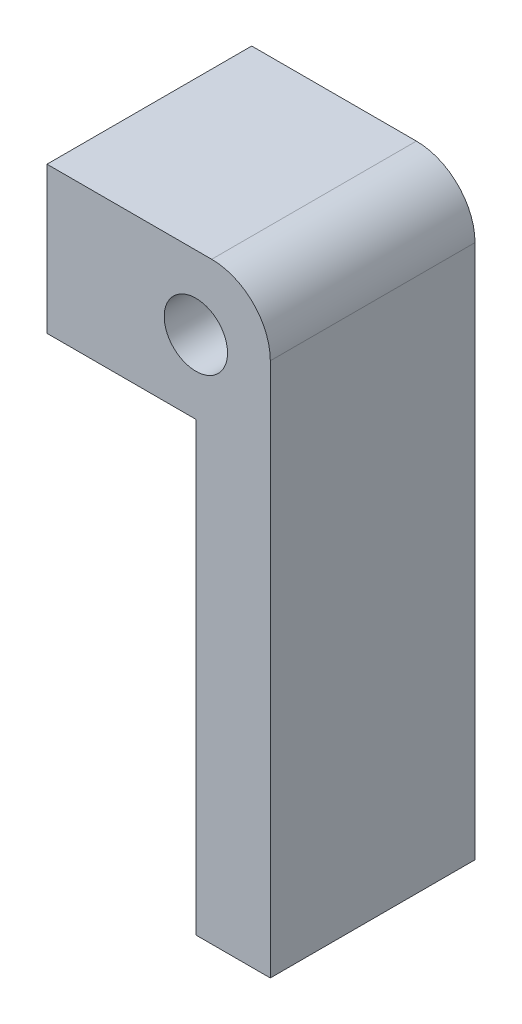
ISO-10303-21;
HEADER;
FILE_DESCRIPTION(('STEP AP214'),'2;1');
FILE_NAME('part.step','',(''),(''),'','','');
FILE_SCHEMA(('AUTOMOTIVE_DESIGN { 1 0 10303 214 1 1 1 1 }'));
ENDSEC;
DATA;
#1=APPLICATION_CONTEXT('core data for automotive mechanical design processes');
#2=APPLICATION_PROTOCOL_DEFINITION('international standard','automotive_design',2000,#1);
#3=PRODUCT_CONTEXT('',#1,'mechanical');
#4=PRODUCT('Part','Part','',(#3));
#5=PRODUCT_RELATED_PRODUCT_CATEGORY('part','',(#4));
#6=PRODUCT_DEFINITION_FORMATION('','',#4);
#7=PRODUCT_DEFINITION_CONTEXT('part definition',#1,'design');
#8=PRODUCT_DEFINITION('design','',#6,#7);
#9=PRODUCT_DEFINITION_SHAPE('','',#8);
#10=(LENGTH_UNIT() NAMED_UNIT(*) SI_UNIT(.MILLI.,.METRE.));
#11=(NAMED_UNIT(*) PLANE_ANGLE_UNIT() SI_UNIT($,.RADIAN.));
#12=(NAMED_UNIT(*) SI_UNIT($,.STERADIAN.) SOLID_ANGLE_UNIT());
#13=UNCERTAINTY_MEASURE_WITH_UNIT(LENGTH_MEASURE(1.E-05),#10,'distance_accuracy_value','');
#14=(GEOMETRIC_REPRESENTATION_CONTEXT(3) GLOBAL_UNCERTAINTY_ASSIGNED_CONTEXT((#13)) GLOBAL_UNIT_ASSIGNED_CONTEXT((#10,
#11,#12)) REPRESENTATION_CONTEXT('',''));
#15=CARTESIAN_POINT('',(0.,0.,0.));
#16=DIRECTION('',(0.,0.,1.));
#17=DIRECTION('',(1.,0.,0.));
#18=AXIS2_PLACEMENT_3D('',#15,#16,#17);
#19=CARTESIAN_POINT('',(0.,0.,34.925));
#20=DIRECTION('',(0.,1.,0.));
#21=DIRECTION('',(0.,0.,1.));
#22=AXIS2_PLACEMENT_3D('',#19,#20,#21);
#23=PLANE('',#22);
#24=DIRECTION('',(1.,0.,0.));
#25=VECTOR('',#24,1.);
#26=CARTESIAN_POINT('',(0.,0.,0.));
#27=LINE('',#26,#25);
#28=CARTESIAN_POINT('',(0.,0.,0.));
#29=VERTEX_POINT('',#28);
#30=CARTESIAN_POINT('',(25.4,0.,0.));
#31=VERTEX_POINT('',#30);
#32=EDGE_CURVE('E127',#29,#31,#27,.T.);
#33=ORIENTED_EDGE('',*,*,#32,.T.);
#34=DIRECTION('',(0.,0.,-1.));
#35=VECTOR('',#34,1.);
#36=CARTESIAN_POINT('',(25.4,0.,34.925));
#37=LINE('',#36,#35);
#38=CARTESIAN_POINT('',(25.4,0.,34.925));
#39=VERTEX_POINT('',#38);
#40=EDGE_CURVE('E105',#39,#31,#37,.T.);
#41=ORIENTED_EDGE('',*,*,#40,.F.);
#42=DIRECTION('',(1.,0.,0.));
#43=VECTOR('',#42,1.);
#44=CARTESIAN_POINT('',(0.,0.,34.925));
#45=LINE('',#44,#43);
#46=CARTESIAN_POINT('',(0.,0.,34.925));
#47=VERTEX_POINT('',#46);
#48=EDGE_CURVE('E114',#47,#39,#45,.T.);
#49=ORIENTED_EDGE('',*,*,#48,.F.);
#50=DIRECTION('',(0.,0.,-1.));
#51=VECTOR('',#50,1.);
#52=CARTESIAN_POINT('',(0.,0.,34.925));
#53=LINE('',#52,#51);
#54=EDGE_CURVE('E147',#47,#29,#53,.T.);
#55=ORIENTED_EDGE('',*,*,#54,.T.);
#56=EDGE_LOOP('',(#33,#41,#49,#55));
#57=FACE_BOUND('',#56,.T.);
#58=ADVANCED_FACE('F43',(#57),#23,.F.);
#59=CARTESIAN_POINT('',(25.4,0.,34.925));
#60=DIRECTION('',(1.,0.,0.));
#61=DIRECTION('',(0.,1.,0.));
#62=AXIS2_PLACEMENT_3D('',#59,#60,#61);
#63=PLANE('',#62);
#64=DIRECTION('',(0.,-1.,0.));
#65=VECTOR('',#64,1.);
#66=CARTESIAN_POINT('',(25.4,0.,0.));
#67=LINE('',#66,#65);
#68=CARTESIAN_POINT('',(25.4,-76.2,0.));
#69=VERTEX_POINT('',#68);
#70=EDGE_CURVE('E164',#31,#69,#67,.T.);
#71=ORIENTED_EDGE('',*,*,#70,.T.);
#72=DIRECTION('',(0.,0.,-1.));
#73=VECTOR('',#72,1.);
#74=CARTESIAN_POINT('',(25.4,-76.2,34.925));
#75=LINE('',#74,#73);
#76=CARTESIAN_POINT('',(25.4,-76.2,34.925));
#77=VERTEX_POINT('',#76);
#78=EDGE_CURVE('E108',#77,#69,#75,.T.);
#79=ORIENTED_EDGE('',*,*,#78,.F.);
#80=DIRECTION('',(0.,-1.,0.));
#81=VECTOR('',#80,1.);
#82=CARTESIAN_POINT('',(25.4,0.,34.925));
#83=LINE('',#82,#81);
#84=EDGE_CURVE('E101',#39,#77,#83,.T.);
#85=ORIENTED_EDGE('',*,*,#84,.F.);
#86=ORIENTED_EDGE('',*,*,#40,.T.);
#87=EDGE_LOOP('',(#71,#79,#85,#86));
#88=FACE_BOUND('',#87,.T.);
#89=ADVANCED_FACE('F103',(#88),#63,.F.);
#90=CARTESIAN_POINT('',(0.,-76.2,34.925));
#91=DIRECTION('',(0.,1.,0.));
#92=DIRECTION('',(0.,0.,1.));
#93=AXIS2_PLACEMENT_3D('',#90,#91,#92);
#94=PLANE('',#93);
#95=DIRECTION('',(1.,0.,0.));
#96=VECTOR('',#95,1.);
#97=CARTESIAN_POINT('',(0.,-76.2,0.));
#98=LINE('',#97,#96);
#99=CARTESIAN_POINT('',(38.1,-76.2,0.));
#100=VERTEX_POINT('',#99);
#101=EDGE_CURVE('E160',#69,#100,#98,.T.);
#102=ORIENTED_EDGE('',*,*,#101,.T.);
#103=DIRECTION('',(0.,0.,-1.));
#104=VECTOR('',#103,1.);
#105=CARTESIAN_POINT('',(38.1,-76.2,34.925));
#106=LINE('',#105,#104);
#107=CARTESIAN_POINT('',(38.1,-76.2,34.925));
#108=VERTEX_POINT('',#107);
#109=EDGE_CURVE('E135',#108,#100,#106,.T.);
#110=ORIENTED_EDGE('',*,*,#109,.F.);
#111=DIRECTION('',(1.,0.,0.));
#112=VECTOR('',#111,1.);
#113=CARTESIAN_POINT('',(0.,-76.2,34.925));
#114=LINE('',#113,#112);
#115=EDGE_CURVE('E113',#77,#108,#114,.T.);
#116=ORIENTED_EDGE('',*,*,#115,.F.);
#117=ORIENTED_EDGE('',*,*,#78,.T.);
#118=EDGE_LOOP('',(#102,#110,#116,#117));
#119=FACE_BOUND('',#118,.T.);
#120=ADVANCED_FACE('F208',(#119),#94,.F.);
#121=CARTESIAN_POINT('',(38.1,0.,34.925));
#122=DIRECTION('',(1.,0.,0.));
#123=DIRECTION('',(0.,1.,0.));
#124=AXIS2_PLACEMENT_3D('',#121,#122,#123);
#125=PLANE('',#124);
#126=DIRECTION('',(0.,-1.,0.));
#127=VECTOR('',#126,1.);
#128=CARTESIAN_POINT('',(38.1,0.,0.));
#129=LINE('',#128,#127);
#130=CARTESIAN_POINT('',(38.1,15.,0.));
#131=VERTEX_POINT('',#130);
#132=EDGE_CURVE('E157',#131,#100,#129,.T.);
#133=ORIENTED_EDGE('',*,*,#132,.F.);
#134=DIRECTION('',(0.,0.,-1.));
#135=VECTOR('',#134,1.);
#136=CARTESIAN_POINT('',(38.1,15.,34.925));
#137=LINE('',#136,#135);
#138=CARTESIAN_POINT('',(38.1,15.,34.925));
#139=VERTEX_POINT('',#138);
#140=EDGE_CURVE('E52',#131,#139,#137,.F.);
#141=ORIENTED_EDGE('',*,*,#140,.T.);
#142=DIRECTION('',(0.,-1.,0.));
#143=VECTOR('',#142,1.);
#144=CARTESIAN_POINT('',(38.1,0.,34.925));
#145=LINE('',#144,#143);
#146=EDGE_CURVE('E179',#139,#108,#145,.T.);
#147=ORIENTED_EDGE('',*,*,#146,.T.);
#148=ORIENTED_EDGE('',*,*,#109,.T.);
#149=EDGE_LOOP('',(#133,#141,#147,#148));
#150=FACE_BOUND('',#149,.T.);
#151=ADVANCED_FACE('F216',(#150),#125,.T.);
#152=CARTESIAN_POINT('',(0.,25.,34.925));
#153=DIRECTION('',(0.,1.,0.));
#154=DIRECTION('',(0.,0.,1.));
#155=AXIS2_PLACEMENT_3D('',#152,#153,#154);
#156=PLANE('',#155);
#157=DIRECTION('',(1.,0.,0.));
#158=VECTOR('',#157,1.);
#159=CARTESIAN_POINT('',(0.,25.,34.925));
#160=LINE('',#159,#158);
#161=CARTESIAN_POINT('',(0.,25.,34.925));
#162=VERTEX_POINT('',#161);
#163=CARTESIAN_POINT('',(28.1,25.,34.925));
#164=VERTEX_POINT('',#163);
#165=EDGE_CURVE('E175',#162,#164,#160,.T.);
#166=ORIENTED_EDGE('',*,*,#165,.T.);
#167=DIRECTION('',(0.,0.,-1.));
#168=VECTOR('',#167,1.);
#169=CARTESIAN_POINT('',(28.1,25.,34.925));
#170=LINE('',#169,#168);
#171=CARTESIAN_POINT('',(28.1,25.,0.));
#172=VERTEX_POINT('',#171);
#173=EDGE_CURVE('E129',#164,#172,#170,.T.);
#174=ORIENTED_EDGE('',*,*,#173,.T.);
#175=DIRECTION('',(1.,0.,0.));
#176=VECTOR('',#175,1.);
#177=CARTESIAN_POINT('',(0.,25.,0.));
#178=LINE('',#177,#176);
#179=CARTESIAN_POINT('',(0.,25.,0.));
#180=VERTEX_POINT('',#179);
#181=EDGE_CURVE('E154',#180,#172,#178,.T.);
#182=ORIENTED_EDGE('',*,*,#181,.F.);
#183=DIRECTION('',(0.,0.,-1.));
#184=VECTOR('',#183,1.);
#185=CARTESIAN_POINT('',(0.,25.,34.925));
#186=LINE('',#185,#184);
#187=EDGE_CURVE('E144',#162,#180,#186,.T.);
#188=ORIENTED_EDGE('',*,*,#187,.F.);
#189=EDGE_LOOP('',(#166,#174,#182,#188));
#190=FACE_BOUND('',#189,.T.);
#191=ADVANCED_FACE('F212',(#190),#156,.T.);
#192=CARTESIAN_POINT('',(25.4,12.5,34.925));
#193=DIRECTION('',(0.,0.,-1.));
#194=DIRECTION('',(-1.,0.,0.));
#195=AXIS2_PLACEMENT_3D('',#192,#193,#194);
#196=CYLINDRICAL_SURFACE('',#195,5.4);
#197=CARTESIAN_POINT('',(25.4,12.5,34.925));
#198=DIRECTION('',(0.,0.,1.));
#199=DIRECTION('',(1.,0.,0.));
#200=AXIS2_PLACEMENT_3D('',#197,#198,#199);
#201=CIRCLE('',#200,5.4);
#202=CARTESIAN_POINT('',(30.8,12.5,34.925));
#203=VERTEX_POINT('',#202);
#204=EDGE_CURVE('E124',#203,#203,#201,.T.);
#205=ORIENTED_EDGE('',*,*,#204,.T.);
#206=EDGE_LOOP('',(#205));
#207=FACE_BOUND('',#206,.T.);
#208=CARTESIAN_POINT('',(25.4,12.5,0.));
#209=DIRECTION('',(0.,0.,1.));
#210=DIRECTION('',(1.,0.,0.));
#211=AXIS2_PLACEMENT_3D('',#208,#209,#210);
#212=CIRCLE('',#211,5.4);
#213=CARTESIAN_POINT('',(30.8,12.5,0.));
#214=VERTEX_POINT('',#213);
#215=EDGE_CURVE('E169',#214,#214,#212,.T.);
#216=ORIENTED_EDGE('',*,*,#215,.F.);
#217=EDGE_LOOP('',(#216));
#218=FACE_BOUND('',#217,.T.);
#219=ADVANCED_FACE('F188',(#207,#218),#196,.F.);
#220=CARTESIAN_POINT('',(0.,0.,34.925));
#221=DIRECTION('',(-1.,0.,0.));
#222=DIRECTION('',(0.,0.,1.));
#223=AXIS2_PLACEMENT_3D('',#220,#221,#222);
#224=PLANE('',#223);
#225=DIRECTION('',(0.,1.,0.));
#226=VECTOR('',#225,1.);
#227=CARTESIAN_POINT('',(0.,0.,0.));
#228=LINE('',#227,#226);
#229=EDGE_CURVE('E150',#29,#180,#228,.T.);
#230=ORIENTED_EDGE('',*,*,#229,.F.);
#231=ORIENTED_EDGE('',*,*,#54,.F.);
#232=DIRECTION('',(0.,1.,0.));
#233=VECTOR('',#232,1.);
#234=CARTESIAN_POINT('',(0.,0.,34.925));
#235=LINE('',#234,#233);
#236=EDGE_CURVE('E121',#47,#162,#235,.T.);
#237=ORIENTED_EDGE('',*,*,#236,.T.);
#238=ORIENTED_EDGE('',*,*,#187,.T.);
#239=EDGE_LOOP('',(#230,#231,#237,#238));
#240=FACE_BOUND('',#239,.T.);
#241=ADVANCED_FACE('F193',(#240),#224,.T.);
#242=CARTESIAN_POINT('',(0.,0.,34.925));
#243=DIRECTION('',(0.,0.,1.));
#244=DIRECTION('',(1.,0.,0.));
#245=AXIS2_PLACEMENT_3D('',#242,#243,#244);
#246=PLANE('',#245);
#247=ORIENTED_EDGE('',*,*,#204,.F.);
#248=EDGE_LOOP('',(#247));
#249=FACE_BOUND('',#248,.T.);
#250=ORIENTED_EDGE('',*,*,#146,.F.);
#251=CARTESIAN_POINT('',(28.1,15.,34.925));
#252=DIRECTION('',(0.,0.,1.));
#253=DIRECTION('',(1.,0.,0.));
#254=AXIS2_PLACEMENT_3D('',#251,#252,#253);
#255=CIRCLE('',#254,10.);
#256=EDGE_CURVE('E11',#139,#164,#255,.T.);
#257=ORIENTED_EDGE('',*,*,#256,.T.);
#258=ORIENTED_EDGE('',*,*,#165,.F.);
#259=ORIENTED_EDGE('',*,*,#236,.F.);
#260=ORIENTED_EDGE('',*,*,#48,.T.);
#261=ORIENTED_EDGE('',*,*,#84,.T.);
#262=ORIENTED_EDGE('',*,*,#115,.T.);
#263=EDGE_LOOP('',(#250,#257,#258,#259,#260,#261,#262));
#264=FACE_BOUND('',#263,.T.);
#265=ADVANCED_FACE('F118',(#249,#264),#246,.T.);
#266=CARTESIAN_POINT('',(0.,0.,0.));
#267=DIRECTION('',(0.,0.,1.));
#268=DIRECTION('',(1.,0.,0.));
#269=AXIS2_PLACEMENT_3D('',#266,#267,#268);
#270=PLANE('',#269);
#271=ORIENTED_EDGE('',*,*,#215,.T.);
#272=EDGE_LOOP('',(#271));
#273=FACE_BOUND('',#272,.T.);
#274=ORIENTED_EDGE('',*,*,#181,.T.);
#275=CARTESIAN_POINT('',(28.1,15.,0.));
#276=DIRECTION('',(0.,0.,1.));
#277=DIRECTION('',(1.,0.,0.));
#278=AXIS2_PLACEMENT_3D('',#275,#276,#277);
#279=CIRCLE('',#278,10.);
#280=EDGE_CURVE('E66',#172,#131,#279,.F.);
#281=ORIENTED_EDGE('',*,*,#280,.T.);
#282=ORIENTED_EDGE('',*,*,#132,.T.);
#283=ORIENTED_EDGE('',*,*,#101,.F.);
#284=ORIENTED_EDGE('',*,*,#70,.F.);
#285=ORIENTED_EDGE('',*,*,#32,.F.);
#286=ORIENTED_EDGE('',*,*,#229,.T.);
#287=EDGE_LOOP('',(#274,#281,#282,#283,#284,#285,#286));
#288=FACE_BOUND('',#287,.T.);
#289=ADVANCED_FACE('F192',(#273,#288),#270,.F.);
#290=CARTESIAN_POINT('',(28.1,15.,34.925));
#291=DIRECTION('',(0.,0.,-1.));
#292=DIRECTION('',(-1.,0.,0.));
#293=AXIS2_PLACEMENT_3D('',#290,#291,#292);
#294=CYLINDRICAL_SURFACE('',#293,10.);
#295=ORIENTED_EDGE('',*,*,#256,.F.);
#296=ORIENTED_EDGE('',*,*,#140,.F.);
#297=ORIENTED_EDGE('',*,*,#280,.F.);
#298=ORIENTED_EDGE('',*,*,#173,.F.);
#299=EDGE_LOOP('',(#295,#296,#297,#298));
#300=FACE_BOUND('',#299,.T.);
#301=ADVANCED_FACE('F45',(#300),#294,.T.);
#302=CLOSED_SHELL('',(#58,#89,#120,#151,#191,#219,#241,#265,#289,#301));
#303=MANIFOLD_SOLID_BREP('B2',#302);
#304=ADVANCED_BREP_SHAPE_REPRESENTATION('',(#18,#303),#14);
#305=SHAPE_DEFINITION_REPRESENTATION(#9,#304);
ENDSEC;
END-ISO-10303-21;
